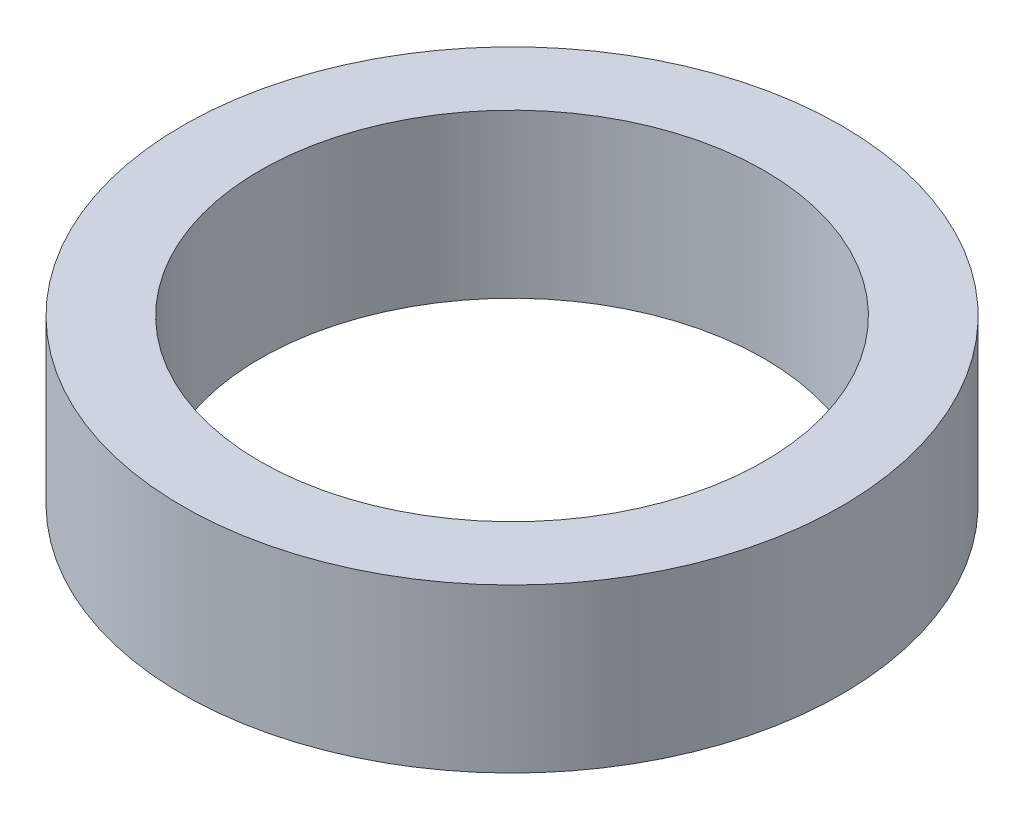
ISO-10303-21;
HEADER;
FILE_DESCRIPTION(('STEP AP214'),'2;1');
FILE_NAME('part.step','',(''),(''),'','','');
FILE_SCHEMA(('AUTOMOTIVE_DESIGN { 1 0 10303 214 1 1 1 1 }'));
ENDSEC;
DATA;
#1=APPLICATION_CONTEXT('core data for automotive mechanical design processes');
#2=APPLICATION_PROTOCOL_DEFINITION('international standard','automotive_design',2000,#1);
#3=PRODUCT_CONTEXT('',#1,'mechanical');
#4=PRODUCT('Part','Part','',(#3));
#5=PRODUCT_RELATED_PRODUCT_CATEGORY('part','',(#4));
#6=PRODUCT_DEFINITION_FORMATION('','',#4);
#7=PRODUCT_DEFINITION_CONTEXT('part definition',#1,'design');
#8=PRODUCT_DEFINITION('design','',#6,#7);
#9=PRODUCT_DEFINITION_SHAPE('','',#8);
#10=(LENGTH_UNIT() NAMED_UNIT(*) SI_UNIT(.MILLI.,.METRE.));
#11=(NAMED_UNIT(*) PLANE_ANGLE_UNIT() SI_UNIT($,.RADIAN.));
#12=(NAMED_UNIT(*) SI_UNIT($,.STERADIAN.) SOLID_ANGLE_UNIT());
#13=UNCERTAINTY_MEASURE_WITH_UNIT(LENGTH_MEASURE(1.E-05),#10,'distance_accuracy_value','');
#14=(GEOMETRIC_REPRESENTATION_CONTEXT(3) GLOBAL_UNCERTAINTY_ASSIGNED_CONTEXT((#13)) GLOBAL_UNIT_ASSIGNED_CONTEXT((#10,
#11,#12)) REPRESENTATION_CONTEXT('',''));
#15=CARTESIAN_POINT('',(0.,0.,0.));
#16=DIRECTION('',(0.,0.,1.));
#17=DIRECTION('',(1.,0.,0.));
#18=AXIS2_PLACEMENT_3D('',#15,#16,#17);
#19=CARTESIAN_POINT('',(0.,21.,0.));
#20=DIRECTION('',(0.,-1.,0.));
#21=DIRECTION('',(0.,0.,-1.));
#22=AXIS2_PLACEMENT_3D('',#19,#20,#21);
#23=CYLINDRICAL_SURFACE('',#22,42.5);
#24=CARTESIAN_POINT('',(0.,21.,0.));
#25=DIRECTION('',(0.,1.,0.));
#26=DIRECTION('',(0.,0.,1.));
#27=AXIS2_PLACEMENT_3D('',#24,#25,#26);
#28=CIRCLE('',#27,42.5);
#29=CARTESIAN_POINT('',(0.,21.,-42.5));
#30=VERTEX_POINT('',#29);
#31=EDGE_CURVE('E10',#30,#30,#28,.T.);
#32=CARTESIAN_POINT('',(0.,0.,0.));
#33=DIRECTION('',(0.,1.,0.));
#34=DIRECTION('',(0.,0.,1.));
#35=AXIS2_PLACEMENT_3D('',#32,#33,#34);
#36=CIRCLE('',#35,42.5);
#37=CARTESIAN_POINT('',(0.,0.,-42.5));
#38=VERTEX_POINT('',#37);
#39=EDGE_CURVE('E37',#38,#38,#36,.T.);
#40=CARTESIAN_POINT('',(0.,21.,-42.5));
#41=CARTESIAN_POINT('',(0.,20.78125,-42.5));
#42=CARTESIAN_POINT('',(0.,20.5625,-42.5));
#43=CARTESIAN_POINT('',(0.,20.125,-42.5));
#44=CARTESIAN_POINT('',(0.,19.90625,-42.5));
#45=CARTESIAN_POINT('',(0.,19.46875,-42.5));
#46=CARTESIAN_POINT('',(0.,19.25,-42.5));
#47=CARTESIAN_POINT('',(0.,18.8125,-42.5));
#48=CARTESIAN_POINT('',(0.,18.59375,-42.5));
#49=CARTESIAN_POINT('',(0.,18.15625,-42.5));
#50=CARTESIAN_POINT('',(0.,17.9375,-42.5));
#51=CARTESIAN_POINT('',(0.,17.5,-42.5));
#52=CARTESIAN_POINT('',(0.,17.28125,-42.5));
#53=CARTESIAN_POINT('',(0.,16.84375,-42.5));
#54=CARTESIAN_POINT('',(0.,16.625,-42.5));
#55=CARTESIAN_POINT('',(0.,16.1875,-42.5));
#56=CARTESIAN_POINT('',(0.,15.96875,-42.5));
#57=CARTESIAN_POINT('',(0.,15.53125,-42.5));
#58=CARTESIAN_POINT('',(0.,15.3125,-42.5));
#59=CARTESIAN_POINT('',(0.,14.875,-42.5));
#60=CARTESIAN_POINT('',(0.,14.65625,-42.5));
#61=CARTESIAN_POINT('',(0.,14.21875,-42.5));
#62=CARTESIAN_POINT('',(0.,14.,-42.5));
#63=CARTESIAN_POINT('',(0.,13.5625,-42.5));
#64=CARTESIAN_POINT('',(0.,13.34375,-42.5));
#65=CARTESIAN_POINT('',(0.,12.90625,-42.5));
#66=CARTESIAN_POINT('',(0.,12.6875,-42.5));
#67=CARTESIAN_POINT('',(0.,12.25,-42.5));
#68=CARTESIAN_POINT('',(0.,12.03125,-42.5));
#69=CARTESIAN_POINT('',(0.,11.59375,-42.5));
#70=CARTESIAN_POINT('',(0.,11.375,-42.5));
#71=CARTESIAN_POINT('',(0.,10.9375,-42.5));
#72=CARTESIAN_POINT('',(0.,10.71875,-42.5));
#73=CARTESIAN_POINT('',(0.,10.28125,-42.5));
#74=CARTESIAN_POINT('',(0.,10.0625,-42.5));
#75=CARTESIAN_POINT('',(0.,9.625,-42.5));
#76=CARTESIAN_POINT('',(0.,9.40625,-42.5));
#77=CARTESIAN_POINT('',(0.,8.96875,-42.5));
#78=CARTESIAN_POINT('',(0.,8.75,-42.5));
#79=CARTESIAN_POINT('',(0.,8.3125,-42.5));
#80=CARTESIAN_POINT('',(0.,8.09375,-42.5));
#81=CARTESIAN_POINT('',(0.,7.65625,-42.5));
#82=CARTESIAN_POINT('',(0.,7.4375,-42.5));
#83=CARTESIAN_POINT('',(0.,7.,-42.5));
#84=CARTESIAN_POINT('',(0.,6.78125,-42.5));
#85=CARTESIAN_POINT('',(0.,6.34375,-42.5));
#86=CARTESIAN_POINT('',(0.,6.125,-42.5));
#87=CARTESIAN_POINT('',(0.,5.6875,-42.5));
#88=CARTESIAN_POINT('',(0.,5.46875,-42.5));
#89=CARTESIAN_POINT('',(0.,5.03125,-42.5));
#90=CARTESIAN_POINT('',(0.,4.8125,-42.5));
#91=CARTESIAN_POINT('',(0.,4.375,-42.5));
#92=CARTESIAN_POINT('',(0.,4.15625,-42.5));
#93=CARTESIAN_POINT('',(0.,3.71875,-42.5));
#94=CARTESIAN_POINT('',(0.,3.5,-42.5));
#95=CARTESIAN_POINT('',(0.,3.0625,-42.5));
#96=CARTESIAN_POINT('',(0.,2.84375,-42.5));
#97=CARTESIAN_POINT('',(0.,2.40625,-42.5));
#98=CARTESIAN_POINT('',(0.,2.1875,-42.5));
#99=CARTESIAN_POINT('',(0.,1.75,-42.5));
#100=CARTESIAN_POINT('',(0.,1.53125,-42.5));
#101=CARTESIAN_POINT('',(0.,1.09375,-42.5));
#102=CARTESIAN_POINT('',(0.,0.875000000000001,-42.5));
#103=CARTESIAN_POINT('',(0.,0.4375,-42.5));
#104=CARTESIAN_POINT('',(0.,0.21875,-42.5));
#105=CARTESIAN_POINT('',(0.,0.,-42.5));
#106=B_SPLINE_CURVE_WITH_KNOTS('',3,(#40,#41,#42,#43,#44,#45,#46,#47,#48,#49,#50,#51,#52,#53,
#54,#55,#56,#57,#58,#59,#60,#61,#62,#63,#64,#65,#66,#67,#68,#69,#70,#71,#72,#73,#74,#75,#76,#77,
#78,#79,#80,#81,#82,#83,#84,#85,#86,#87,#88,#89,#90,#91,#92,#93,#94,#95,#96,#97,#98,#99,#100,
#101,#102,#103,#104,#105),.UNSPECIFIED.,.F.,.F.,(4,2,2,2,2,2,2,2,2,2,2,2,2,2,2,2,2,2,2,2,2,2,2,
2,2,2,2,2,2,2,2,2,4),(0.,0.656249999999997,1.3125,1.96875,2.625,3.28125,3.9375,4.59375,5.25,
5.90625,6.5625,7.21875,7.875,8.53125,9.1875,9.84375,10.5,11.15625,11.8125,12.46875,13.125,
13.78125,14.4375,15.09375,15.75,16.40625,17.0625,17.71875,18.375,19.03125,19.6875,20.34375,21.),.UNSPECIFIED.);
#107=EDGE_CURVE('BSEAM40',#30,#38,#106,.T.);
#108=ORIENTED_EDGE('',*,*,#31,.F.);
#109=ORIENTED_EDGE('',*,*,#39,.T.);
#110=ORIENTED_EDGE('',*,*,#107,.T.);
#111=ORIENTED_EDGE('',*,*,#107,.F.);
#112=EDGE_LOOP('',(#108,#110,#109,#111));
#113=FACE_BOUND('',#112,.T.);
#114=ADVANCED_FACE('F40',(#113),#23,.T.);
#115=CARTESIAN_POINT('',(0.,21.,0.));
#116=DIRECTION('',(0.,1.,0.));
#117=DIRECTION('',(0.,0.,1.));
#118=AXIS2_PLACEMENT_3D('',#115,#116,#117);
#119=PLANE('',#118);
#120=CARTESIAN_POINT('',(0.,21.,0.));
#121=DIRECTION('',(0.,1.,0.));
#122=DIRECTION('',(0.,0.,1.));
#123=AXIS2_PLACEMENT_3D('',#120,#121,#122);
#124=CIRCLE('',#123,32.5);
#125=CARTESIAN_POINT('',(0.,21.,-32.5));
#126=VERTEX_POINT('',#125);
#127=EDGE_CURVE('E50',#126,#126,#124,.T.);
#128=ORIENTED_EDGE('',*,*,#127,.F.);
#129=EDGE_LOOP('',(#128));
#130=FACE_BOUND('',#129,.T.);
#131=ORIENTED_EDGE('',*,*,#31,.T.);
#132=EDGE_LOOP('',(#131));
#133=FACE_BOUND('',#132,.T.);
#134=ADVANCED_FACE('F59',(#130,#133),#119,.T.);
#135=CARTESIAN_POINT('',(0.,0.,0.));
#136=DIRECTION('',(0.,1.,0.));
#137=DIRECTION('',(0.,0.,1.));
#138=AXIS2_PLACEMENT_3D('',#135,#136,#137);
#139=PLANE('',#138);
#140=CARTESIAN_POINT('',(0.,0.,0.));
#141=DIRECTION('',(0.,1.,0.));
#142=DIRECTION('',(0.,0.,1.));
#143=AXIS2_PLACEMENT_3D('',#140,#141,#142);
#144=CIRCLE('',#143,32.5);
#145=CARTESIAN_POINT('',(0.,0.,-32.5));
#146=VERTEX_POINT('',#145);
#147=EDGE_CURVE('E47',#146,#146,#144,.T.);
#148=ORIENTED_EDGE('',*,*,#147,.T.);
#149=EDGE_LOOP('',(#148));
#150=FACE_BOUND('',#149,.T.);
#151=ORIENTED_EDGE('',*,*,#39,.F.);
#152=EDGE_LOOP('',(#151));
#153=FACE_BOUND('',#152,.T.);
#154=ADVANCED_FACE('F58',(#150,#153),#139,.F.);
#155=CARTESIAN_POINT('',(0.,21.,0.));
#156=DIRECTION('',(0.,-1.,0.));
#157=DIRECTION('',(0.,0.,-1.));
#158=AXIS2_PLACEMENT_3D('',#155,#156,#157);
#159=CYLINDRICAL_SURFACE('',#158,32.5);
#160=CARTESIAN_POINT('',(0.,21.,-32.5));
#161=CARTESIAN_POINT('',(0.,20.78125,-32.5));
#162=CARTESIAN_POINT('',(0.,20.5625,-32.5));
#163=CARTESIAN_POINT('',(0.,20.125,-32.5));
#164=CARTESIAN_POINT('',(0.,19.90625,-32.5));
#165=CARTESIAN_POINT('',(0.,19.46875,-32.5));
#166=CARTESIAN_POINT('',(0.,19.25,-32.5));
#167=CARTESIAN_POINT('',(0.,18.8125,-32.5));
#168=CARTESIAN_POINT('',(0.,18.59375,-32.5));
#169=CARTESIAN_POINT('',(0.,18.15625,-32.5));
#170=CARTESIAN_POINT('',(0.,17.9375,-32.5));
#171=CARTESIAN_POINT('',(0.,17.5,-32.5));
#172=CARTESIAN_POINT('',(0.,17.28125,-32.5));
#173=CARTESIAN_POINT('',(0.,16.84375,-32.5));
#174=CARTESIAN_POINT('',(0.,16.625,-32.5));
#175=CARTESIAN_POINT('',(0.,16.1875,-32.5));
#176=CARTESIAN_POINT('',(0.,15.96875,-32.5));
#177=CARTESIAN_POINT('',(0.,15.53125,-32.5));
#178=CARTESIAN_POINT('',(0.,15.3125,-32.5));
#179=CARTESIAN_POINT('',(0.,14.875,-32.5));
#180=CARTESIAN_POINT('',(0.,14.65625,-32.5));
#181=CARTESIAN_POINT('',(0.,14.21875,-32.5));
#182=CARTESIAN_POINT('',(0.,14.,-32.5));
#183=CARTESIAN_POINT('',(0.,13.5625,-32.5));
#184=CARTESIAN_POINT('',(0.,13.34375,-32.5));
#185=CARTESIAN_POINT('',(0.,12.90625,-32.5));
#186=CARTESIAN_POINT('',(0.,12.6875,-32.5));
#187=CARTESIAN_POINT('',(0.,12.25,-32.5));
#188=CARTESIAN_POINT('',(0.,12.03125,-32.5));
#189=CARTESIAN_POINT('',(0.,11.59375,-32.5));
#190=CARTESIAN_POINT('',(0.,11.375,-32.5));
#191=CARTESIAN_POINT('',(0.,10.9375,-32.5));
#192=CARTESIAN_POINT('',(0.,10.71875,-32.5));
#193=CARTESIAN_POINT('',(0.,10.28125,-32.5));
#194=CARTESIAN_POINT('',(0.,10.0625,-32.5));
#195=CARTESIAN_POINT('',(0.,9.625,-32.5));
#196=CARTESIAN_POINT('',(0.,9.40625,-32.5));
#197=CARTESIAN_POINT('',(0.,8.96875,-32.5));
#198=CARTESIAN_POINT('',(0.,8.75,-32.5));
#199=CARTESIAN_POINT('',(0.,8.3125,-32.5));
#200=CARTESIAN_POINT('',(0.,8.09375,-32.5));
#201=CARTESIAN_POINT('',(0.,7.65625,-32.5));
#202=CARTESIAN_POINT('',(0.,7.4375,-32.5));
#203=CARTESIAN_POINT('',(0.,7.,-32.5));
#204=CARTESIAN_POINT('',(0.,6.78125,-32.5));
#205=CARTESIAN_POINT('',(0.,6.34375,-32.5));
#206=CARTESIAN_POINT('',(0.,6.125,-32.5));
#207=CARTESIAN_POINT('',(0.,5.6875,-32.5));
#208=CARTESIAN_POINT('',(0.,5.46875,-32.5));
#209=CARTESIAN_POINT('',(0.,5.03125,-32.5));
#210=CARTESIAN_POINT('',(0.,4.8125,-32.5));
#211=CARTESIAN_POINT('',(0.,4.375,-32.5));
#212=CARTESIAN_POINT('',(0.,4.15625,-32.5));
#213=CARTESIAN_POINT('',(0.,3.71875,-32.5));
#214=CARTESIAN_POINT('',(0.,3.5,-32.5));
#215=CARTESIAN_POINT('',(0.,3.0625,-32.5));
#216=CARTESIAN_POINT('',(0.,2.84375,-32.5));
#217=CARTESIAN_POINT('',(0.,2.40625,-32.5));
#218=CARTESIAN_POINT('',(0.,2.1875,-32.5));
#219=CARTESIAN_POINT('',(0.,1.75,-32.5));
#220=CARTESIAN_POINT('',(0.,1.53125,-32.5));
#221=CARTESIAN_POINT('',(0.,1.09375,-32.5));
#222=CARTESIAN_POINT('',(0.,0.875000000000001,-32.5));
#223=CARTESIAN_POINT('',(0.,0.4375,-32.5));
#224=CARTESIAN_POINT('',(0.,0.21875,-32.5));
#225=CARTESIAN_POINT('',(0.,0.,-32.5));
#226=B_SPLINE_CURVE_WITH_KNOTS('',3,(#160,#161,#162,#163,#164,#165,#166,#167,#168,#169,#170,
#171,#172,#173,#174,#175,#176,#177,#178,#179,#180,#181,#182,#183,#184,#185,#186,#187,#188,#189,
#190,#191,#192,#193,#194,#195,#196,#197,#198,#199,#200,#201,#202,#203,#204,#205,#206,#207,#208,
#209,#210,#211,#212,#213,#214,#215,#216,#217,#218,#219,#220,#221,#222,#223,#224,#225),
.UNSPECIFIED.,.F.,.F.,(4,2,2,2,2,2,2,2,2,2,2,2,2,2,2,2,2,2,2,2,2,2,2,2,2,2,2,2,2,2,2,2,4),(0.,
0.656249999999997,1.3125,1.96875,2.625,3.28125,3.9375,4.59375,5.25,5.90625,6.5625,7.21875,7.875,
8.53125,9.1875,9.84375,10.5,11.15625,11.8125,12.46875,13.125,13.78125,14.4375,15.09375,15.75,
16.40625,17.0625,17.71875,18.375,19.03125,19.6875,20.34375,21.),.UNSPECIFIED.);
#227=EDGE_CURVE('BSEAM54',#126,#146,#226,.T.);
#228=ORIENTED_EDGE('',*,*,#127,.T.);
#229=ORIENTED_EDGE('',*,*,#147,.F.);
#230=ORIENTED_EDGE('',*,*,#227,.T.);
#231=ORIENTED_EDGE('',*,*,#227,.F.);
#232=EDGE_LOOP('',(#228,#230,#229,#231));
#233=FACE_BOUND('',#232,.T.);
#234=ADVANCED_FACE('F54',(#233),#159,.F.);
#235=CLOSED_SHELL('',(#114,#134,#154,#234));
#236=MANIFOLD_SOLID_BREP('B2',#235);
#237=ADVANCED_BREP_SHAPE_REPRESENTATION('',(#18,#236),#14);
#238=SHAPE_DEFINITION_REPRESENTATION(#9,#237);
ENDSEC;
END-ISO-10303-21;
